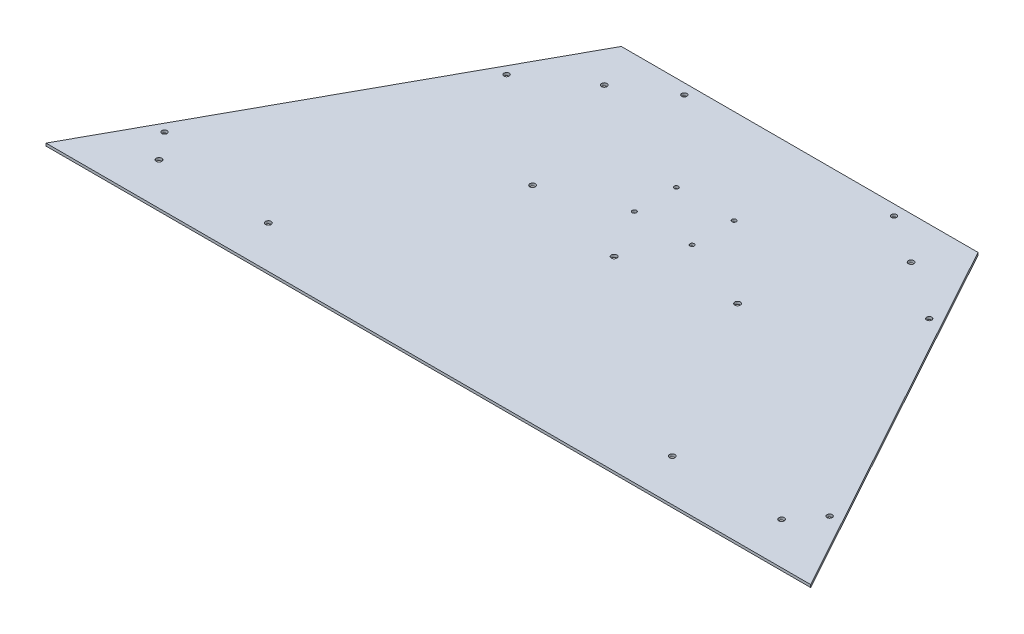
ISO-10303-21;
HEADER;
FILE_DESCRIPTION(('STEP AP214'),'2;1');
FILE_NAME('part.step','',(''),(''),'','','');
FILE_SCHEMA(('AUTOMOTIVE_DESIGN { 1 0 10303 214 1 1 1 1 }'));
ENDSEC;
DATA;
#1=APPLICATION_CONTEXT('core data for automotive mechanical design processes');
#2=APPLICATION_PROTOCOL_DEFINITION('international standard','automotive_design',2000,#1);
#3=PRODUCT_CONTEXT('',#1,'mechanical');
#4=PRODUCT('Part','Part','',(#3));
#5=PRODUCT_RELATED_PRODUCT_CATEGORY('part','',(#4));
#6=PRODUCT_DEFINITION_FORMATION('','',#4);
#7=PRODUCT_DEFINITION_CONTEXT('part definition',#1,'design');
#8=PRODUCT_DEFINITION('design','',#6,#7);
#9=PRODUCT_DEFINITION_SHAPE('','',#8);
#10=(LENGTH_UNIT() NAMED_UNIT(*) SI_UNIT(.MILLI.,.METRE.));
#11=(NAMED_UNIT(*) PLANE_ANGLE_UNIT() SI_UNIT($,.RADIAN.));
#12=(NAMED_UNIT(*) SI_UNIT($,.STERADIAN.) SOLID_ANGLE_UNIT());
#13=UNCERTAINTY_MEASURE_WITH_UNIT(LENGTH_MEASURE(1.E-05),#10,'distance_accuracy_value','');
#14=(GEOMETRIC_REPRESENTATION_CONTEXT(3) GLOBAL_UNCERTAINTY_ASSIGNED_CONTEXT((#13)) GLOBAL_UNIT_ASSIGNED_CONTEXT((#10,
#11,#12)) REPRESENTATION_CONTEXT('',''));
#15=CARTESIAN_POINT('',(0.,0.,0.));
#16=DIRECTION('',(0.,0.,1.));
#17=DIRECTION('',(1.,0.,0.));
#18=AXIS2_PLACEMENT_3D('',#15,#16,#17);
#19=CARTESIAN_POINT('',(0.,0.,0.));
#20=DIRECTION('',(0.,-1.,0.));
#21=DIRECTION('',(0.,0.,-1.));
#22=AXIS2_PLACEMENT_3D('',#19,#20,#21);
#23=PLANE('',#22);
#24=CARTESIAN_POINT('',(-34.925,0.,-334.965026529998));
#25=DIRECTION('',(0.,1.,0.));
#26=DIRECTION('',(0.,0.,1.));
#27=AXIS2_PLACEMENT_3D('',#24,#25,#26);
#28=CIRCLE('',#27,2.5527);
#29=CARTESIAN_POINT('',(-34.925,0.,-332.412326529998));
#30=VERTEX_POINT('',#29);
#31=EDGE_CURVE('E221',#30,#30,#28,.T.);
#32=ORIENTED_EDGE('',*,*,#31,.T.);
#33=EDGE_LOOP('',(#32));
#34=FACE_BOUND('',#33,.T.);
#35=CARTESIAN_POINT('',(-34.925,0.,-284.165026529998));
#36=DIRECTION('',(0.,1.,0.));
#37=DIRECTION('',(0.,0.,1.));
#38=AXIS2_PLACEMENT_3D('',#35,#36,#37);
#39=CIRCLE('',#38,2.5527);
#40=CARTESIAN_POINT('',(-34.925,0.,-281.612326529998));
#41=VERTEX_POINT('',#40);
#42=EDGE_CURVE('E215',#41,#41,#39,.T.);
#43=ORIENTED_EDGE('',*,*,#42,.T.);
#44=EDGE_LOOP('',(#43));
#45=FACE_BOUND('',#44,.T.);
#46=CARTESIAN_POINT('',(34.925,0.,-284.165026529998));
#47=DIRECTION('',(0.,1.,0.));
#48=DIRECTION('',(0.,0.,1.));
#49=AXIS2_PLACEMENT_3D('',#46,#47,#48);
#50=CIRCLE('',#49,2.5527);
#51=CARTESIAN_POINT('',(34.925,0.,-281.612326529998));
#52=VERTEX_POINT('',#51);
#53=EDGE_CURVE('E209',#52,#52,#50,.T.);
#54=ORIENTED_EDGE('',*,*,#53,.T.);
#55=EDGE_LOOP('',(#54));
#56=FACE_BOUND('',#55,.T.);
#57=CARTESIAN_POINT('',(0.,0.,-224.79));
#58=DIRECTION('',(0.,1.,0.));
#59=DIRECTION('',(0.,0.,1.));
#60=AXIS2_PLACEMENT_3D('',#57,#58,#59);
#61=CIRCLE('',#60,3.37819999999989);
#62=CARTESIAN_POINT('',(0.,0.,-221.4118));
#63=VERTEX_POINT('',#62);
#64=EDGE_CURVE('E173',#63,#63,#61,.T.);
#65=ORIENTED_EDGE('',*,*,#64,.T.);
#66=EDGE_LOOP('',(#65));
#67=FACE_BOUND('',#66,.T.);
#68=CARTESIAN_POINT('',(376.682,0.,-50.8000000000002));
#69=DIRECTION('',(0.,1.,0.));
#70=DIRECTION('',(0.,0.,1.));
#71=AXIS2_PLACEMENT_3D('',#68,#69,#70);
#72=CIRCLE('',#71,3.37819999999989);
#73=CARTESIAN_POINT('',(376.682,0.,-47.4218000000003));
#74=VERTEX_POINT('',#73);
#75=EDGE_CURVE('E167',#74,#74,#72,.T.);
#76=ORIENTED_EDGE('',*,*,#75,.T.);
#77=EDGE_LOOP('',(#76));
#78=FACE_BOUND('',#77,.T.);
#79=CARTESIAN_POINT('',(244.348,0.,-50.8000000000001));
#80=DIRECTION('',(0.,1.,0.));
#81=DIRECTION('',(0.,0.,1.));
#82=AXIS2_PLACEMENT_3D('',#79,#80,#81);
#83=CIRCLE('',#82,3.37819999999989);
#84=CARTESIAN_POINT('',(244.348,0.,-47.4218000000002));
#85=VERTEX_POINT('',#84);
#86=EDGE_CURVE('E161',#85,#85,#83,.T.);
#87=ORIENTED_EDGE('',*,*,#86,.T.);
#88=EDGE_LOOP('',(#87));
#89=FACE_BOUND('',#88,.T.);
#90=CARTESIAN_POINT('',(185.674,0.,-398.526));
#91=DIRECTION('',(0.,1.,0.));
#92=DIRECTION('',(0.,0.,1.));
#93=AXIS2_PLACEMENT_3D('',#90,#91,#92);
#94=CIRCLE('',#93,3.37819999999989);
#95=CARTESIAN_POINT('',(185.674,0.,-395.1478));
#96=VERTEX_POINT('',#95);
#97=EDGE_CURVE('E155',#96,#96,#94,.T.);
#98=ORIENTED_EDGE('',*,*,#97,.T.);
#99=EDGE_LOOP('',(#98));
#100=FACE_BOUND('',#99,.T.);
#101=CARTESIAN_POINT('',(123.952,0.,-250.19));
#102=DIRECTION('',(0.,1.,0.));
#103=DIRECTION('',(0.,0.,1.));
#104=AXIS2_PLACEMENT_3D('',#101,#102,#103);
#105=CIRCLE('',#104,3.37819999999989);
#106=CARTESIAN_POINT('',(123.952,0.,-246.8118));
#107=VERTEX_POINT('',#106);
#108=EDGE_CURVE('E149',#107,#107,#105,.T.);
#109=ORIENTED_EDGE('',*,*,#108,.T.);
#110=EDGE_LOOP('',(#109));
#111=FACE_BOUND('',#110,.T.);
#112=CARTESIAN_POINT('',(-402.368285269326,0.,-83.1601712777647));
#113=DIRECTION('',(0.,1.,0.));
#114=DIRECTION('',(0.,0.,1.));
#115=AXIS2_PLACEMENT_3D('',#112,#113,#114);
#116=CIRCLE('',#115,3.17499999999987);
#117=CARTESIAN_POINT('',(-402.368285269326,0.,-79.9851712777648));
#118=VERTEX_POINT('',#117);
#119=EDGE_CURVE('E143',#118,#118,#116,.T.);
#120=ORIENTED_EDGE('',*,*,#119,.T.);
#121=EDGE_LOOP('',(#120));
#122=FACE_BOUND('',#121,.T.);
#123=CARTESIAN_POINT('',(-255.632309055253,0.,-350.31479557707));
#124=DIRECTION('',(0.,1.,0.));
#125=DIRECTION('',(0.,0.,1.));
#126=AXIS2_PLACEMENT_3D('',#123,#124,#125);
#127=CIRCLE('',#126,3.17499999999987);
#128=CARTESIAN_POINT('',(-255.632309055253,0.,-347.13979557707));
#129=VERTEX_POINT('',#128);
#130=EDGE_CURVE('E137',#129,#129,#127,.T.);
#131=ORIENTED_EDGE('',*,*,#130,.T.);
#132=EDGE_LOOP('',(#131));
#133=FACE_BOUND('',#132,.T.);
#134=DIRECTION('',(1.,0.,0.));
#135=VECTOR('',#134,1.);
#136=CARTESIAN_POINT('',(462.534,0.,-1.08537011059561E-13));
#137=LINE('',#136,#135);
#138=CARTESIAN_POINT('',(-462.534,0.,0.));
#139=VERTEX_POINT('',#138);
#140=CARTESIAN_POINT('',(462.534,0.,-1.08537011059561E-13));
#141=VERTEX_POINT('',#140);
#142=EDGE_CURVE('E100',#139,#141,#137,.T.);
#143=ORIENTED_EDGE('',*,*,#142,.F.);
#144=DIRECTION('',(-0.481417244796828,0.,0.876491549538403));
#145=VECTOR('',#144,1.);
#146=CARTESIAN_POINT('',(-462.534,0.,0.));
#147=LINE('',#146,#145);
#148=CARTESIAN_POINT('',(-215.773,0.,-449.265026529998));
#149=VERTEX_POINT('',#148);
#150=EDGE_CURVE('E75',#149,#139,#147,.T.);
#151=ORIENTED_EDGE('',*,*,#150,.F.);
#152=DIRECTION('',(-1.,0.,0.));
#153=VECTOR('',#152,1.);
#154=CARTESIAN_POINT('',(-215.773,0.,-449.265026529998));
#155=LINE('',#154,#153);
#156=CARTESIAN_POINT('',(215.773,0.,-449.265026529998));
#157=VERTEX_POINT('',#156);
#158=EDGE_CURVE('E69',#157,#149,#155,.T.);
#159=ORIENTED_EDGE('',*,*,#158,.F.);
#160=DIRECTION('',(-0.481417244796829,0.,-0.876491549538403));
#161=VECTOR('',#160,1.);
#162=CARTESIAN_POINT('',(215.773,0.,-449.265026529998));
#163=LINE('',#162,#161);
#164=EDGE_CURVE('E92',#141,#157,#163,.T.);
#165=ORIENTED_EDGE('',*,*,#164,.F.);
#166=EDGE_LOOP('',(#143,#151,#159,#165));
#167=FACE_BOUND('',#166,.T.);
#168=CARTESIAN_POINT('',(126.873,0.,-436.565026529998));
#169=DIRECTION('',(0.,1.,0.));
#170=DIRECTION('',(0.,0.,1.));
#171=AXIS2_PLACEMENT_3D('',#168,#169,#170);
#172=CIRCLE('',#171,3.1749999999999);
#173=CARTESIAN_POINT('',(126.873,0.,-433.390026529998));
#174=VERTEX_POINT('',#173);
#175=EDGE_CURVE('E103',#174,#174,#172,.T.);
#176=ORIENTED_EDGE('',*,*,#175,.T.);
#177=EDGE_LOOP('',(#176));
#178=FACE_BOUND('',#177,.T.);
#179=CARTESIAN_POINT('',(255.632309055253,0.,-350.31479557707));
#180=DIRECTION('',(0.,1.,0.));
#181=DIRECTION('',(0.,0.,1.));
#182=AXIS2_PLACEMENT_3D('',#179,#180,#181);
#183=CIRCLE('',#182,3.17499999999987);
#184=CARTESIAN_POINT('',(255.632309055253,0.,-347.13979557707));
#185=VERTEX_POINT('',#184);
#186=EDGE_CURVE('E119',#185,#185,#183,.T.);
#187=ORIENTED_EDGE('',*,*,#186,.T.);
#188=EDGE_LOOP('',(#187));
#189=FACE_BOUND('',#188,.T.);
#190=CARTESIAN_POINT('',(402.368285269326,0.,-83.1601712777649));
#191=DIRECTION('',(0.,1.,0.));
#192=DIRECTION('',(0.,0.,1.));
#193=AXIS2_PLACEMENT_3D('',#190,#191,#192);
#194=CIRCLE('',#193,3.17499999999987);
#195=CARTESIAN_POINT('',(402.368285269326,0.,-79.9851712777651));
#196=VERTEX_POINT('',#195);
#197=EDGE_CURVE('E125',#196,#196,#194,.T.);
#198=ORIENTED_EDGE('',*,*,#197,.T.);
#199=EDGE_LOOP('',(#198));
#200=FACE_BOUND('',#199,.T.);
#201=CARTESIAN_POINT('',(-126.873,0.,-436.565026529998));
#202=DIRECTION('',(0.,1.,0.));
#203=DIRECTION('',(0.,0.,1.));
#204=AXIS2_PLACEMENT_3D('',#201,#202,#203);
#205=CIRCLE('',#204,3.17499999999989);
#206=CARTESIAN_POINT('',(-126.873,0.,-433.390026529998));
#207=VERTEX_POINT('',#206);
#208=EDGE_CURVE('E131',#207,#207,#205,.T.);
#209=ORIENTED_EDGE('',*,*,#208,.T.);
#210=EDGE_LOOP('',(#209));
#211=FACE_BOUND('',#210,.T.);
#212=CARTESIAN_POINT('',(-185.674,0.,-398.526));
#213=DIRECTION('',(0.,1.,0.));
#214=DIRECTION('',(0.,0.,1.));
#215=AXIS2_PLACEMENT_3D('',#212,#213,#214);
#216=CIRCLE('',#215,3.37819999999989);
#217=CARTESIAN_POINT('',(-185.674,0.,-395.1478));
#218=VERTEX_POINT('',#217);
#219=EDGE_CURVE('E179',#218,#218,#216,.T.);
#220=ORIENTED_EDGE('',*,*,#219,.T.);
#221=EDGE_LOOP('',(#220));
#222=FACE_BOUND('',#221,.T.);
#223=CARTESIAN_POINT('',(-123.952,0.,-250.19));
#224=DIRECTION('',(0.,1.,0.));
#225=DIRECTION('',(0.,0.,1.));
#226=AXIS2_PLACEMENT_3D('',#223,#224,#225);
#227=CIRCLE('',#226,3.37819999999989);
#228=CARTESIAN_POINT('',(-123.952,0.,-246.8118));
#229=VERTEX_POINT('',#228);
#230=EDGE_CURVE('E185',#229,#229,#227,.T.);
#231=ORIENTED_EDGE('',*,*,#230,.T.);
#232=EDGE_LOOP('',(#231));
#233=FACE_BOUND('',#232,.T.);
#234=CARTESIAN_POINT('',(-244.348,0.,-50.7999999999999));
#235=DIRECTION('',(0.,1.,0.));
#236=DIRECTION('',(0.,0.,1.));
#237=AXIS2_PLACEMENT_3D('',#234,#235,#236);
#238=CIRCLE('',#237,3.37819999999989);
#239=CARTESIAN_POINT('',(-244.348,0.,-47.4218));
#240=VERTEX_POINT('',#239);
#241=EDGE_CURVE('E191',#240,#240,#238,.T.);
#242=ORIENTED_EDGE('',*,*,#241,.T.);
#243=EDGE_LOOP('',(#242));
#244=FACE_BOUND('',#243,.T.);
#245=CARTESIAN_POINT('',(-376.682,0.,-50.7999999999999));
#246=DIRECTION('',(0.,1.,0.));
#247=DIRECTION('',(0.,0.,1.));
#248=AXIS2_PLACEMENT_3D('',#245,#246,#247);
#249=CIRCLE('',#248,3.37819999999989);
#250=CARTESIAN_POINT('',(-376.682,0.,-47.4218));
#251=VERTEX_POINT('',#250);
#252=EDGE_CURVE('E197',#251,#251,#249,.T.);
#253=ORIENTED_EDGE('',*,*,#252,.T.);
#254=EDGE_LOOP('',(#253));
#255=FACE_BOUND('',#254,.T.);
#256=CARTESIAN_POINT('',(34.925,0.,-334.965026529998));
#257=DIRECTION('',(0.,1.,0.));
#258=DIRECTION('',(0.,0.,1.));
#259=AXIS2_PLACEMENT_3D('',#256,#257,#258);
#260=CIRCLE('',#259,2.5527);
#261=CARTESIAN_POINT('',(34.925,0.,-332.412326529998));
#262=VERTEX_POINT('',#261);
#263=EDGE_CURVE('E203',#262,#262,#260,.T.);
#264=ORIENTED_EDGE('',*,*,#263,.T.);
#265=EDGE_LOOP('',(#264));
#266=FACE_BOUND('',#265,.T.);
#267=ADVANCED_FACE('F35',(#34,#45,#56,#67,#78,#89,#100,#111,#122,#133,#167,#178,#189,#200,#211,
#222,#233,#244,#255,#266),#23,.T.);
#268=CARTESIAN_POINT('',(0.,3.175,0.));
#269=DIRECTION('',(0.,-1.,0.));
#270=DIRECTION('',(0.,0.,-1.));
#271=AXIS2_PLACEMENT_3D('',#268,#269,#270);
#272=PLANE('',#271);
#273=CARTESIAN_POINT('',(-34.925,3.175,-334.965026529998));
#274=DIRECTION('',(0.,1.,0.));
#275=DIRECTION('',(0.,0.,1.));
#276=AXIS2_PLACEMENT_3D('',#273,#274,#275);
#277=CIRCLE('',#276,2.5527);
#278=CARTESIAN_POINT('',(-34.925,3.175,-332.412326529998));
#279=VERTEX_POINT('',#278);
#280=EDGE_CURVE('E224',#279,#279,#277,.T.);
#281=ORIENTED_EDGE('',*,*,#280,.F.);
#282=EDGE_LOOP('',(#281));
#283=FACE_BOUND('',#282,.T.);
#284=CARTESIAN_POINT('',(-34.925,3.175,-284.165026529998));
#285=DIRECTION('',(0.,1.,0.));
#286=DIRECTION('',(0.,0.,1.));
#287=AXIS2_PLACEMENT_3D('',#284,#285,#286);
#288=CIRCLE('',#287,2.5527);
#289=CARTESIAN_POINT('',(-34.925,3.175,-281.612326529998));
#290=VERTEX_POINT('',#289);
#291=EDGE_CURVE('E218',#290,#290,#288,.T.);
#292=ORIENTED_EDGE('',*,*,#291,.F.);
#293=EDGE_LOOP('',(#292));
#294=FACE_BOUND('',#293,.T.);
#295=CARTESIAN_POINT('',(34.925,3.175,-284.165026529998));
#296=DIRECTION('',(0.,1.,0.));
#297=DIRECTION('',(0.,0.,1.));
#298=AXIS2_PLACEMENT_3D('',#295,#296,#297);
#299=CIRCLE('',#298,2.5527);
#300=CARTESIAN_POINT('',(34.925,3.175,-281.612326529998));
#301=VERTEX_POINT('',#300);
#302=EDGE_CURVE('E212',#301,#301,#299,.T.);
#303=ORIENTED_EDGE('',*,*,#302,.F.);
#304=EDGE_LOOP('',(#303));
#305=FACE_BOUND('',#304,.T.);
#306=CARTESIAN_POINT('',(34.925,3.175,-334.965026529998));
#307=DIRECTION('',(0.,1.,0.));
#308=DIRECTION('',(0.,0.,1.));
#309=AXIS2_PLACEMENT_3D('',#306,#307,#308);
#310=CIRCLE('',#309,2.5527);
#311=CARTESIAN_POINT('',(34.925,3.175,-332.412326529998));
#312=VERTEX_POINT('',#311);
#313=EDGE_CURVE('E206',#312,#312,#310,.T.);
#314=ORIENTED_EDGE('',*,*,#313,.F.);
#315=EDGE_LOOP('',(#314));
#316=FACE_BOUND('',#315,.T.);
#317=CARTESIAN_POINT('',(-376.682,3.175,-50.7999999999999));
#318=DIRECTION('',(0.,1.,0.));
#319=DIRECTION('',(0.,0.,1.));
#320=AXIS2_PLACEMENT_3D('',#317,#318,#319);
#321=CIRCLE('',#320,3.37819999999989);
#322=CARTESIAN_POINT('',(-376.682,3.175,-47.4218));
#323=VERTEX_POINT('',#322);
#324=EDGE_CURVE('E200',#323,#323,#321,.T.);
#325=ORIENTED_EDGE('',*,*,#324,.F.);
#326=EDGE_LOOP('',(#325));
#327=FACE_BOUND('',#326,.T.);
#328=CARTESIAN_POINT('',(-244.348,3.175,-50.7999999999999));
#329=DIRECTION('',(0.,1.,0.));
#330=DIRECTION('',(0.,0.,1.));
#331=AXIS2_PLACEMENT_3D('',#328,#329,#330);
#332=CIRCLE('',#331,3.37819999999989);
#333=CARTESIAN_POINT('',(-244.348,3.175,-47.4218));
#334=VERTEX_POINT('',#333);
#335=EDGE_CURVE('E194',#334,#334,#332,.T.);
#336=ORIENTED_EDGE('',*,*,#335,.F.);
#337=EDGE_LOOP('',(#336));
#338=FACE_BOUND('',#337,.T.);
#339=CARTESIAN_POINT('',(-123.952,3.175,-250.19));
#340=DIRECTION('',(0.,1.,0.));
#341=DIRECTION('',(0.,0.,1.));
#342=AXIS2_PLACEMENT_3D('',#339,#340,#341);
#343=CIRCLE('',#342,3.37819999999989);
#344=CARTESIAN_POINT('',(-123.952,3.175,-246.8118));
#345=VERTEX_POINT('',#344);
#346=EDGE_CURVE('E188',#345,#345,#343,.T.);
#347=ORIENTED_EDGE('',*,*,#346,.F.);
#348=EDGE_LOOP('',(#347));
#349=FACE_BOUND('',#348,.T.);
#350=CARTESIAN_POINT('',(-185.674,3.175,-398.526));
#351=DIRECTION('',(0.,1.,0.));
#352=DIRECTION('',(0.,0.,1.));
#353=AXIS2_PLACEMENT_3D('',#350,#351,#352);
#354=CIRCLE('',#353,3.37819999999989);
#355=CARTESIAN_POINT('',(-185.674,3.175,-395.1478));
#356=VERTEX_POINT('',#355);
#357=EDGE_CURVE('E182',#356,#356,#354,.T.);
#358=ORIENTED_EDGE('',*,*,#357,.F.);
#359=EDGE_LOOP('',(#358));
#360=FACE_BOUND('',#359,.T.);
#361=CARTESIAN_POINT('',(244.348,3.175,-50.8000000000001));
#362=DIRECTION('',(0.,1.,0.));
#363=DIRECTION('',(0.,0.,1.));
#364=AXIS2_PLACEMENT_3D('',#361,#362,#363);
#365=CIRCLE('',#364,3.37819999999989);
#366=CARTESIAN_POINT('',(244.348,3.175,-47.4218000000002));
#367=VERTEX_POINT('',#366);
#368=EDGE_CURVE('E164',#367,#367,#365,.T.);
#369=ORIENTED_EDGE('',*,*,#368,.F.);
#370=EDGE_LOOP('',(#369));
#371=FACE_BOUND('',#370,.T.);
#372=CARTESIAN_POINT('',(185.674,3.175,-398.526));
#373=DIRECTION('',(0.,1.,0.));
#374=DIRECTION('',(0.,0.,1.));
#375=AXIS2_PLACEMENT_3D('',#372,#373,#374);
#376=CIRCLE('',#375,3.37819999999989);
#377=CARTESIAN_POINT('',(185.674,3.175,-395.1478));
#378=VERTEX_POINT('',#377);
#379=EDGE_CURVE('E158',#378,#378,#376,.T.);
#380=ORIENTED_EDGE('',*,*,#379,.F.);
#381=EDGE_LOOP('',(#380));
#382=FACE_BOUND('',#381,.T.);
#383=CARTESIAN_POINT('',(123.952,3.175,-250.19));
#384=DIRECTION('',(0.,1.,0.));
#385=DIRECTION('',(0.,0.,1.));
#386=AXIS2_PLACEMENT_3D('',#383,#384,#385);
#387=CIRCLE('',#386,3.37819999999989);
#388=CARTESIAN_POINT('',(123.952,3.175,-246.8118));
#389=VERTEX_POINT('',#388);
#390=EDGE_CURVE('E152',#389,#389,#387,.T.);
#391=ORIENTED_EDGE('',*,*,#390,.F.);
#392=EDGE_LOOP('',(#391));
#393=FACE_BOUND('',#392,.T.);
#394=CARTESIAN_POINT('',(-402.368285269326,3.175,-83.1601712777647));
#395=DIRECTION('',(0.,1.,0.));
#396=DIRECTION('',(0.,0.,1.));
#397=AXIS2_PLACEMENT_3D('',#394,#395,#396);
#398=CIRCLE('',#397,3.17499999999987);
#399=CARTESIAN_POINT('',(-402.368285269326,3.175,-79.9851712777648));
#400=VERTEX_POINT('',#399);
#401=EDGE_CURVE('E146',#400,#400,#398,.T.);
#402=ORIENTED_EDGE('',*,*,#401,.F.);
#403=EDGE_LOOP('',(#402));
#404=FACE_BOUND('',#403,.T.);
#405=CARTESIAN_POINT('',(-255.632309055253,3.175,-350.31479557707));
#406=DIRECTION('',(0.,1.,0.));
#407=DIRECTION('',(0.,0.,1.));
#408=AXIS2_PLACEMENT_3D('',#405,#406,#407);
#409=CIRCLE('',#408,3.17499999999987);
#410=CARTESIAN_POINT('',(-255.632309055253,3.175,-347.13979557707));
#411=VERTEX_POINT('',#410);
#412=EDGE_CURVE('E140',#411,#411,#409,.T.);
#413=ORIENTED_EDGE('',*,*,#412,.F.);
#414=EDGE_LOOP('',(#413));
#415=FACE_BOUND('',#414,.T.);
#416=CARTESIAN_POINT('',(-126.873,3.175,-436.565026529998));
#417=DIRECTION('',(0.,1.,0.));
#418=DIRECTION('',(0.,0.,1.));
#419=AXIS2_PLACEMENT_3D('',#416,#417,#418);
#420=CIRCLE('',#419,3.17499999999989);
#421=CARTESIAN_POINT('',(-126.873,3.175,-433.390026529998));
#422=VERTEX_POINT('',#421);
#423=EDGE_CURVE('E134',#422,#422,#420,.T.);
#424=ORIENTED_EDGE('',*,*,#423,.F.);
#425=EDGE_LOOP('',(#424));
#426=FACE_BOUND('',#425,.T.);
#427=CARTESIAN_POINT('',(402.368285269326,3.175,-83.1601712777649));
#428=DIRECTION('',(0.,1.,0.));
#429=DIRECTION('',(0.,0.,1.));
#430=AXIS2_PLACEMENT_3D('',#427,#428,#429);
#431=CIRCLE('',#430,3.17499999999987);
#432=CARTESIAN_POINT('',(402.368285269326,3.175,-79.9851712777651));
#433=VERTEX_POINT('',#432);
#434=EDGE_CURVE('E128',#433,#433,#431,.T.);
#435=ORIENTED_EDGE('',*,*,#434,.F.);
#436=EDGE_LOOP('',(#435));
#437=FACE_BOUND('',#436,.T.);
#438=CARTESIAN_POINT('',(255.632309055253,3.175,-350.31479557707));
#439=DIRECTION('',(0.,1.,0.));
#440=DIRECTION('',(0.,0.,1.));
#441=AXIS2_PLACEMENT_3D('',#438,#439,#440);
#442=CIRCLE('',#441,3.17499999999987);
#443=CARTESIAN_POINT('',(255.632309055253,3.175,-347.13979557707));
#444=VERTEX_POINT('',#443);
#445=EDGE_CURVE('E122',#444,#444,#442,.T.);
#446=ORIENTED_EDGE('',*,*,#445,.F.);
#447=EDGE_LOOP('',(#446));
#448=FACE_BOUND('',#447,.T.);
#449=CARTESIAN_POINT('',(126.873,3.175,-436.565026529998));
#450=DIRECTION('',(0.,1.,0.));
#451=DIRECTION('',(0.,0.,1.));
#452=AXIS2_PLACEMENT_3D('',#449,#450,#451);
#453=CIRCLE('',#452,3.1749999999999);
#454=CARTESIAN_POINT('',(126.873,3.175,-433.390026529998));
#455=VERTEX_POINT('',#454);
#456=EDGE_CURVE('E116',#455,#455,#453,.T.);
#457=ORIENTED_EDGE('',*,*,#456,.F.);
#458=EDGE_LOOP('',(#457));
#459=FACE_BOUND('',#458,.T.);
#460=DIRECTION('',(1.,0.,0.));
#461=VECTOR('',#460,1.);
#462=CARTESIAN_POINT('',(462.534,3.175,-1.08537011059561E-13));
#463=LINE('',#462,#461);
#464=CARTESIAN_POINT('',(-462.534,3.175,0.));
#465=VERTEX_POINT('',#464);
#466=CARTESIAN_POINT('',(462.534,3.175,-1.08537011059561E-13));
#467=VERTEX_POINT('',#466);
#468=EDGE_CURVE('E88',#465,#467,#463,.T.);
#469=ORIENTED_EDGE('',*,*,#468,.T.);
#470=DIRECTION('',(-0.481417244796829,0.,-0.876491549538403));
#471=VECTOR('',#470,1.);
#472=CARTESIAN_POINT('',(215.773,3.175,-449.265026529998));
#473=LINE('',#472,#471);
#474=CARTESIAN_POINT('',(215.773,3.175,-449.265026529998));
#475=VERTEX_POINT('',#474);
#476=EDGE_CURVE('E82',#467,#475,#473,.T.);
#477=ORIENTED_EDGE('',*,*,#476,.T.);
#478=DIRECTION('',(-1.,0.,0.));
#479=VECTOR('',#478,1.);
#480=CARTESIAN_POINT('',(-215.773,3.175,-449.265026529998));
#481=LINE('',#480,#479);
#482=CARTESIAN_POINT('',(-215.773,3.175,-449.265026529998));
#483=VERTEX_POINT('',#482);
#484=EDGE_CURVE('E86',#475,#483,#481,.T.);
#485=ORIENTED_EDGE('',*,*,#484,.T.);
#486=DIRECTION('',(-0.481417244796828,0.,0.876491549538403));
#487=VECTOR('',#486,1.);
#488=CARTESIAN_POINT('',(-462.534,3.175,0.));
#489=LINE('',#488,#487);
#490=EDGE_CURVE('E52',#483,#465,#489,.T.);
#491=ORIENTED_EDGE('',*,*,#490,.T.);
#492=EDGE_LOOP('',(#469,#477,#485,#491));
#493=FACE_BOUND('',#492,.T.);
#494=CARTESIAN_POINT('',(376.682,3.175,-50.8000000000002));
#495=DIRECTION('',(0.,1.,0.));
#496=DIRECTION('',(0.,0.,1.));
#497=AXIS2_PLACEMENT_3D('',#494,#495,#496);
#498=CIRCLE('',#497,3.37819999999989);
#499=CARTESIAN_POINT('',(376.682,3.175,-47.4218000000003));
#500=VERTEX_POINT('',#499);
#501=EDGE_CURVE('E170',#500,#500,#498,.T.);
#502=ORIENTED_EDGE('',*,*,#501,.F.);
#503=EDGE_LOOP('',(#502));
#504=FACE_BOUND('',#503,.T.);
#505=CARTESIAN_POINT('',(0.,3.175,-224.79));
#506=DIRECTION('',(0.,1.,0.));
#507=DIRECTION('',(0.,0.,1.));
#508=AXIS2_PLACEMENT_3D('',#505,#506,#507);
#509=CIRCLE('',#508,3.37819999999989);
#510=CARTESIAN_POINT('',(0.,3.175,-221.4118));
#511=VERTEX_POINT('',#510);
#512=EDGE_CURVE('E176',#511,#511,#509,.T.);
#513=ORIENTED_EDGE('',*,*,#512,.F.);
#514=EDGE_LOOP('',(#513));
#515=FACE_BOUND('',#514,.T.);
#516=ADVANCED_FACE('F83',(#283,#294,#305,#316,#327,#338,#349,#360,#371,#382,#393,#404,#415,#426,
#437,#448,#459,#493,#504,#515),#272,.F.);
#517=CARTESIAN_POINT('',(462.534,3.175,-1.08537011059561E-13));
#518=DIRECTION('',(0.,0.,-1.));
#519=DIRECTION('',(-1.,0.,0.));
#520=AXIS2_PLACEMENT_3D('',#517,#518,#519);
#521=PLANE('',#520);
#522=ORIENTED_EDGE('',*,*,#142,.T.);
#523=DIRECTION('',(0.,-1.,0.));
#524=VECTOR('',#523,1.);
#525=CARTESIAN_POINT('',(462.534,3.175,-1.08537011059561E-13));
#526=LINE('',#525,#524);
#527=EDGE_CURVE('E11',#467,#141,#526,.T.);
#528=ORIENTED_EDGE('',*,*,#527,.F.);
#529=ORIENTED_EDGE('',*,*,#468,.F.);
#530=DIRECTION('',(0.,-1.,0.));
#531=VECTOR('',#530,1.);
#532=CARTESIAN_POINT('',(-462.534,3.175,0.));
#533=LINE('',#532,#531);
#534=EDGE_CURVE('E96',#465,#139,#533,.T.);
#535=ORIENTED_EDGE('',*,*,#534,.T.);
#536=EDGE_LOOP('',(#522,#528,#529,#535));
#537=FACE_BOUND('',#536,.T.);
#538=ADVANCED_FACE('F37',(#537),#521,.F.);
#539=CARTESIAN_POINT('',(215.773,3.175,-449.265026529998));
#540=DIRECTION('',(-0.876491549538403,0.,0.481417244796829));
#541=DIRECTION('',(0.481417244796829,0.,0.876491549538403));
#542=AXIS2_PLACEMENT_3D('',#539,#540,#541);
#543=PLANE('',#542);
#544=ORIENTED_EDGE('',*,*,#164,.T.);
#545=DIRECTION('',(0.,-1.,0.));
#546=VECTOR('',#545,1.);
#547=CARTESIAN_POINT('',(215.773,3.175,-449.265026529998));
#548=LINE('',#547,#546);
#549=EDGE_CURVE('E44',#475,#157,#548,.T.);
#550=ORIENTED_EDGE('',*,*,#549,.F.);
#551=ORIENTED_EDGE('',*,*,#476,.F.);
#552=ORIENTED_EDGE('',*,*,#527,.T.);
#553=EDGE_LOOP('',(#544,#550,#551,#552));
#554=FACE_BOUND('',#553,.T.);
#555=ADVANCED_FACE('F91',(#554),#543,.F.);
#556=CARTESIAN_POINT('',(-215.773,3.175,-449.265026529998));
#557=DIRECTION('',(0.,0.,1.));
#558=DIRECTION('',(1.,0.,0.));
#559=AXIS2_PLACEMENT_3D('',#556,#557,#558);
#560=PLANE('',#559);
#561=ORIENTED_EDGE('',*,*,#158,.T.);
#562=DIRECTION('',(0.,-1.,0.));
#563=VECTOR('',#562,1.);
#564=CARTESIAN_POINT('',(-215.773,3.175,-449.265026529998));
#565=LINE('',#564,#563);
#566=EDGE_CURVE('E93',#483,#149,#565,.T.);
#567=ORIENTED_EDGE('',*,*,#566,.F.);
#568=ORIENTED_EDGE('',*,*,#484,.F.);
#569=ORIENTED_EDGE('',*,*,#549,.T.);
#570=EDGE_LOOP('',(#561,#567,#568,#569));
#571=FACE_BOUND('',#570,.T.);
#572=ADVANCED_FACE('F94',(#571),#560,.F.);
#573=CARTESIAN_POINT('',(-462.534,3.175,0.));
#574=DIRECTION('',(0.876491549538403,0.,0.481417244796828));
#575=DIRECTION('',(0.481417244796828,0.,-0.876491549538403));
#576=AXIS2_PLACEMENT_3D('',#573,#574,#575);
#577=PLANE('',#576);
#578=ORIENTED_EDGE('',*,*,#150,.T.);
#579=ORIENTED_EDGE('',*,*,#534,.F.);
#580=ORIENTED_EDGE('',*,*,#490,.F.);
#581=ORIENTED_EDGE('',*,*,#566,.T.);
#582=EDGE_LOOP('',(#578,#579,#580,#581));
#583=FACE_BOUND('',#582,.T.);
#584=ADVANCED_FACE('F108',(#583),#577,.F.);
#585=CARTESIAN_POINT('',(126.873,3.175,-436.565026529998));
#586=DIRECTION('',(0.,1.,0.));
#587=DIRECTION('',(0.,0.,1.));
#588=AXIS2_PLACEMENT_3D('',#585,#586,#587);
#589=CYLINDRICAL_SURFACE('',#588,3.1749999999999);
#590=ORIENTED_EDGE('',*,*,#175,.F.);
#591=EDGE_LOOP('',(#590));
#592=FACE_BOUND('',#591,.T.);
#593=ORIENTED_EDGE('',*,*,#456,.T.);
#594=EDGE_LOOP('',(#593));
#595=FACE_BOUND('',#594,.T.);
#596=ADVANCED_FACE('F265',(#592,#595),#589,.F.);
#597=CARTESIAN_POINT('',(255.632309055253,3.175,-350.31479557707));
#598=DIRECTION('',(0.,1.,0.));
#599=DIRECTION('',(0.,0.,1.));
#600=AXIS2_PLACEMENT_3D('',#597,#598,#599);
#601=CYLINDRICAL_SURFACE('',#600,3.17499999999987);
#602=ORIENTED_EDGE('',*,*,#186,.F.);
#603=EDGE_LOOP('',(#602));
#604=FACE_BOUND('',#603,.T.);
#605=ORIENTED_EDGE('',*,*,#445,.T.);
#606=EDGE_LOOP('',(#605));
#607=FACE_BOUND('',#606,.T.);
#608=ADVANCED_FACE('F267',(#604,#607),#601,.F.);
#609=CARTESIAN_POINT('',(402.368285269326,3.175,-83.1601712777649));
#610=DIRECTION('',(0.,1.,0.));
#611=DIRECTION('',(0.,0.,1.));
#612=AXIS2_PLACEMENT_3D('',#609,#610,#611);
#613=CYLINDRICAL_SURFACE('',#612,3.17499999999987);
#614=ORIENTED_EDGE('',*,*,#197,.F.);
#615=EDGE_LOOP('',(#614));
#616=FACE_BOUND('',#615,.T.);
#617=ORIENTED_EDGE('',*,*,#434,.T.);
#618=EDGE_LOOP('',(#617));
#619=FACE_BOUND('',#618,.T.);
#620=ADVANCED_FACE('F274',(#616,#619),#613,.F.);
#621=CARTESIAN_POINT('',(-126.873,3.175,-436.565026529998));
#622=DIRECTION('',(0.,1.,0.));
#623=DIRECTION('',(0.,0.,1.));
#624=AXIS2_PLACEMENT_3D('',#621,#622,#623);
#625=CYLINDRICAL_SURFACE('',#624,3.17499999999989);
#626=ORIENTED_EDGE('',*,*,#208,.F.);
#627=EDGE_LOOP('',(#626));
#628=FACE_BOUND('',#627,.T.);
#629=ORIENTED_EDGE('',*,*,#423,.T.);
#630=EDGE_LOOP('',(#629));
#631=FACE_BOUND('',#630,.T.);
#632=ADVANCED_FACE('F390',(#628,#631),#625,.F.);
#633=CARTESIAN_POINT('',(-255.632309055253,3.175,-350.31479557707));
#634=DIRECTION('',(0.,1.,0.));
#635=DIRECTION('',(0.,0.,1.));
#636=AXIS2_PLACEMENT_3D('',#633,#634,#635);
#637=CYLINDRICAL_SURFACE('',#636,3.17499999999987);
#638=ORIENTED_EDGE('',*,*,#130,.F.);
#639=EDGE_LOOP('',(#638));
#640=FACE_BOUND('',#639,.T.);
#641=ORIENTED_EDGE('',*,*,#412,.T.);
#642=EDGE_LOOP('',(#641));
#643=FACE_BOUND('',#642,.T.);
#644=ADVANCED_FACE('F386',(#640,#643),#637,.F.);
#645=CARTESIAN_POINT('',(-402.368285269326,3.175,-83.1601712777647));
#646=DIRECTION('',(0.,1.,0.));
#647=DIRECTION('',(0.,0.,1.));
#648=AXIS2_PLACEMENT_3D('',#645,#646,#647);
#649=CYLINDRICAL_SURFACE('',#648,3.17499999999987);
#650=ORIENTED_EDGE('',*,*,#119,.F.);
#651=EDGE_LOOP('',(#650));
#652=FACE_BOUND('',#651,.T.);
#653=ORIENTED_EDGE('',*,*,#401,.T.);
#654=EDGE_LOOP('',(#653));
#655=FACE_BOUND('',#654,.T.);
#656=ADVANCED_FACE('F382',(#652,#655),#649,.F.);
#657=CARTESIAN_POINT('',(123.952,3.175,-250.19));
#658=DIRECTION('',(0.,1.,0.));
#659=DIRECTION('',(0.,0.,1.));
#660=AXIS2_PLACEMENT_3D('',#657,#658,#659);
#661=CYLINDRICAL_SURFACE('',#660,3.37819999999989);
#662=ORIENTED_EDGE('',*,*,#108,.F.);
#663=EDGE_LOOP('',(#662));
#664=FACE_BOUND('',#663,.T.);
#665=ORIENTED_EDGE('',*,*,#390,.T.);
#666=EDGE_LOOP('',(#665));
#667=FACE_BOUND('',#666,.T.);
#668=ADVANCED_FACE('F378',(#664,#667),#661,.F.);
#669=CARTESIAN_POINT('',(185.674,3.175,-398.526));
#670=DIRECTION('',(0.,1.,0.));
#671=DIRECTION('',(0.,0.,1.));
#672=AXIS2_PLACEMENT_3D('',#669,#670,#671);
#673=CYLINDRICAL_SURFACE('',#672,3.37819999999989);
#674=ORIENTED_EDGE('',*,*,#97,.F.);
#675=EDGE_LOOP('',(#674));
#676=FACE_BOUND('',#675,.T.);
#677=ORIENTED_EDGE('',*,*,#379,.T.);
#678=EDGE_LOOP('',(#677));
#679=FACE_BOUND('',#678,.T.);
#680=ADVANCED_FACE('F374',(#676,#679),#673,.F.);
#681=CARTESIAN_POINT('',(244.348,3.175,-50.8000000000001));
#682=DIRECTION('',(0.,1.,0.));
#683=DIRECTION('',(0.,0.,1.));
#684=AXIS2_PLACEMENT_3D('',#681,#682,#683);
#685=CYLINDRICAL_SURFACE('',#684,3.37819999999989);
#686=ORIENTED_EDGE('',*,*,#86,.F.);
#687=EDGE_LOOP('',(#686));
#688=FACE_BOUND('',#687,.T.);
#689=ORIENTED_EDGE('',*,*,#368,.T.);
#690=EDGE_LOOP('',(#689));
#691=FACE_BOUND('',#690,.T.);
#692=ADVANCED_FACE('F370',(#688,#691),#685,.F.);
#693=CARTESIAN_POINT('',(376.682,3.175,-50.8000000000002));
#694=DIRECTION('',(0.,1.,0.));
#695=DIRECTION('',(0.,0.,1.));
#696=AXIS2_PLACEMENT_3D('',#693,#694,#695);
#697=CYLINDRICAL_SURFACE('',#696,3.37819999999989);
#698=ORIENTED_EDGE('',*,*,#75,.F.);
#699=EDGE_LOOP('',(#698));
#700=FACE_BOUND('',#699,.T.);
#701=ORIENTED_EDGE('',*,*,#501,.T.);
#702=EDGE_LOOP('',(#701));
#703=FACE_BOUND('',#702,.T.);
#704=ADVANCED_FACE('F366',(#700,#703),#697,.F.);
#705=CARTESIAN_POINT('',(0.,3.175,-224.79));
#706=DIRECTION('',(0.,1.,0.));
#707=DIRECTION('',(0.,0.,1.));
#708=AXIS2_PLACEMENT_3D('',#705,#706,#707);
#709=CYLINDRICAL_SURFACE('',#708,3.37819999999989);
#710=ORIENTED_EDGE('',*,*,#64,.F.);
#711=EDGE_LOOP('',(#710));
#712=FACE_BOUND('',#711,.T.);
#713=ORIENTED_EDGE('',*,*,#512,.T.);
#714=EDGE_LOOP('',(#713));
#715=FACE_BOUND('',#714,.T.);
#716=ADVANCED_FACE('F362',(#712,#715),#709,.F.);
#717=CARTESIAN_POINT('',(-185.674,3.175,-398.526));
#718=DIRECTION('',(0.,1.,0.));
#719=DIRECTION('',(0.,0.,1.));
#720=AXIS2_PLACEMENT_3D('',#717,#718,#719);
#721=CYLINDRICAL_SURFACE('',#720,3.37819999999989);
#722=ORIENTED_EDGE('',*,*,#219,.F.);
#723=EDGE_LOOP('',(#722));
#724=FACE_BOUND('',#723,.T.);
#725=ORIENTED_EDGE('',*,*,#357,.T.);
#726=EDGE_LOOP('',(#725));
#727=FACE_BOUND('',#726,.T.);
#728=ADVANCED_FACE('F358',(#724,#727),#721,.F.);
#729=CARTESIAN_POINT('',(-123.952,3.175,-250.19));
#730=DIRECTION('',(0.,1.,0.));
#731=DIRECTION('',(0.,0.,1.));
#732=AXIS2_PLACEMENT_3D('',#729,#730,#731);
#733=CYLINDRICAL_SURFACE('',#732,3.37819999999989);
#734=ORIENTED_EDGE('',*,*,#230,.F.);
#735=EDGE_LOOP('',(#734));
#736=FACE_BOUND('',#735,.T.);
#737=ORIENTED_EDGE('',*,*,#346,.T.);
#738=EDGE_LOOP('',(#737));
#739=FACE_BOUND('',#738,.T.);
#740=ADVANCED_FACE('F354',(#736,#739),#733,.F.);
#741=CARTESIAN_POINT('',(-244.348,3.175,-50.7999999999999));
#742=DIRECTION('',(0.,1.,0.));
#743=DIRECTION('',(0.,0.,1.));
#744=AXIS2_PLACEMENT_3D('',#741,#742,#743);
#745=CYLINDRICAL_SURFACE('',#744,3.37819999999989);
#746=ORIENTED_EDGE('',*,*,#241,.F.);
#747=EDGE_LOOP('',(#746));
#748=FACE_BOUND('',#747,.T.);
#749=ORIENTED_EDGE('',*,*,#335,.T.);
#750=EDGE_LOOP('',(#749));
#751=FACE_BOUND('',#750,.T.);
#752=ADVANCED_FACE('F350',(#748,#751),#745,.F.);
#753=CARTESIAN_POINT('',(-376.682,3.175,-50.7999999999999));
#754=DIRECTION('',(0.,1.,0.));
#755=DIRECTION('',(0.,0.,1.));
#756=AXIS2_PLACEMENT_3D('',#753,#754,#755);
#757=CYLINDRICAL_SURFACE('',#756,3.37819999999989);
#758=ORIENTED_EDGE('',*,*,#252,.F.);
#759=EDGE_LOOP('',(#758));
#760=FACE_BOUND('',#759,.T.);
#761=ORIENTED_EDGE('',*,*,#324,.T.);
#762=EDGE_LOOP('',(#761));
#763=FACE_BOUND('',#762,.T.);
#764=ADVANCED_FACE('F313',(#760,#763),#757,.F.);
#765=CARTESIAN_POINT('',(34.925,3.175,-334.965026529998));
#766=DIRECTION('',(0.,1.,0.));
#767=DIRECTION('',(0.,0.,1.));
#768=AXIS2_PLACEMENT_3D('',#765,#766,#767);
#769=CYLINDRICAL_SURFACE('',#768,2.5527);
#770=ORIENTED_EDGE('',*,*,#263,.F.);
#771=EDGE_LOOP('',(#770));
#772=FACE_BOUND('',#771,.T.);
#773=ORIENTED_EDGE('',*,*,#313,.T.);
#774=EDGE_LOOP('',(#773));
#775=FACE_BOUND('',#774,.T.);
#776=ADVANCED_FACE('F307',(#772,#775),#769,.F.);
#777=CARTESIAN_POINT('',(34.925,3.175,-284.165026529998));
#778=DIRECTION('',(0.,1.,0.));
#779=DIRECTION('',(0.,0.,1.));
#780=AXIS2_PLACEMENT_3D('',#777,#778,#779);
#781=CYLINDRICAL_SURFACE('',#780,2.5527);
#782=ORIENTED_EDGE('',*,*,#53,.F.);
#783=EDGE_LOOP('',(#782));
#784=FACE_BOUND('',#783,.T.);
#785=ORIENTED_EDGE('',*,*,#302,.T.);
#786=EDGE_LOOP('',(#785));
#787=FACE_BOUND('',#786,.T.);
#788=ADVANCED_FACE('F312',(#784,#787),#781,.F.);
#789=CARTESIAN_POINT('',(-34.925,3.175,-284.165026529998));
#790=DIRECTION('',(0.,1.,0.));
#791=DIRECTION('',(0.,0.,1.));
#792=AXIS2_PLACEMENT_3D('',#789,#790,#791);
#793=CYLINDRICAL_SURFACE('',#792,2.5527);
#794=ORIENTED_EDGE('',*,*,#42,.F.);
#795=EDGE_LOOP('',(#794));
#796=FACE_BOUND('',#795,.T.);
#797=ORIENTED_EDGE('',*,*,#291,.T.);
#798=EDGE_LOOP('',(#797));
#799=FACE_BOUND('',#798,.T.);
#800=ADVANCED_FACE('F324',(#796,#799),#793,.F.);
#801=CARTESIAN_POINT('',(-34.925,3.175,-334.965026529998));
#802=DIRECTION('',(0.,1.,0.));
#803=DIRECTION('',(0.,0.,1.));
#804=AXIS2_PLACEMENT_3D('',#801,#802,#803);
#805=CYLINDRICAL_SURFACE('',#804,2.5527);
#806=ORIENTED_EDGE('',*,*,#31,.F.);
#807=EDGE_LOOP('',(#806));
#808=FACE_BOUND('',#807,.T.);
#809=ORIENTED_EDGE('',*,*,#280,.T.);
#810=EDGE_LOOP('',(#809));
#811=FACE_BOUND('',#810,.T.);
#812=ADVANCED_FACE('F228',(#808,#811),#805,.F.);
#813=CLOSED_SHELL('',(#267,#516,#538,#555,#572,#584,#596,#608,#620,#632,#644,#656,#668,#680,
#692,#704,#716,#728,#740,#752,#764,#776,#788,#800,#812));
#814=MANIFOLD_SOLID_BREP('B2',#813);
#815=ADVANCED_BREP_SHAPE_REPRESENTATION('',(#18,#814),#14);
#816=SHAPE_DEFINITION_REPRESENTATION(#9,#815);
ENDSEC;
END-ISO-10303-21;
